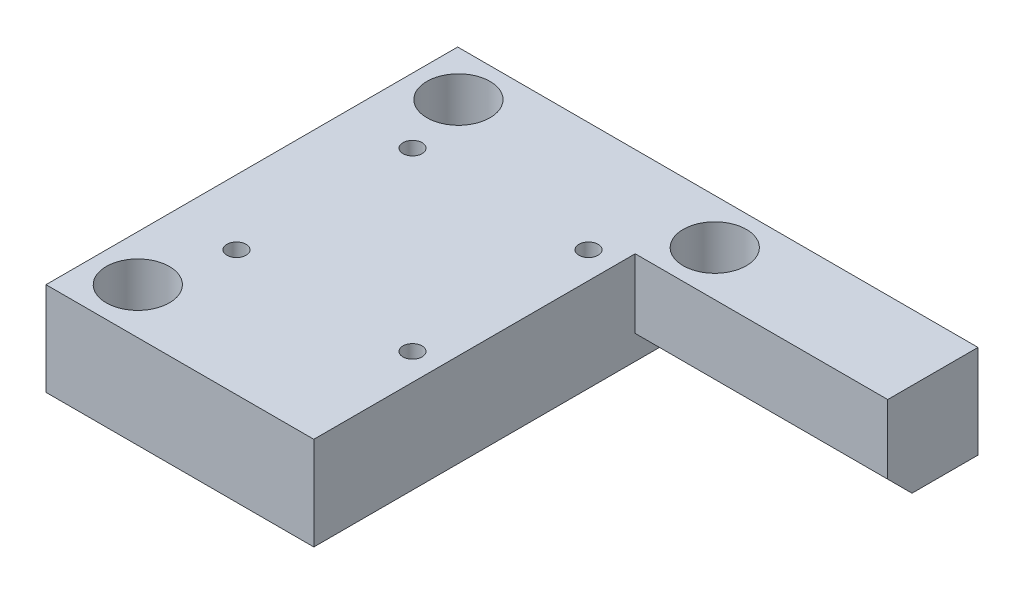
ISO-10303-21;
HEADER;
FILE_DESCRIPTION(('STEP AP214'),'2;1');
FILE_NAME('part.step','',(''),(''),'','','');
FILE_SCHEMA(('AUTOMOTIVE_DESIGN { 1 0 10303 214 1 1 1 1 }'));
ENDSEC;
DATA;
#1=APPLICATION_CONTEXT('core data for automotive mechanical design processes');
#2=APPLICATION_PROTOCOL_DEFINITION('international standard','automotive_design',2000,#1);
#3=PRODUCT_CONTEXT('',#1,'mechanical');
#4=PRODUCT('Part','Part','',(#3));
#5=PRODUCT_RELATED_PRODUCT_CATEGORY('part','',(#4));
#6=PRODUCT_DEFINITION_FORMATION('','',#4);
#7=PRODUCT_DEFINITION_CONTEXT('part definition',#1,'design');
#8=PRODUCT_DEFINITION('design','',#6,#7);
#9=PRODUCT_DEFINITION_SHAPE('','',#8);
#10=(LENGTH_UNIT() NAMED_UNIT(*) SI_UNIT(.MILLI.,.METRE.));
#11=(NAMED_UNIT(*) PLANE_ANGLE_UNIT() SI_UNIT($,.RADIAN.));
#12=(NAMED_UNIT(*) SI_UNIT($,.STERADIAN.) SOLID_ANGLE_UNIT());
#13=UNCERTAINTY_MEASURE_WITH_UNIT(LENGTH_MEASURE(1.E-05),#10,'distance_accuracy_value','');
#14=(GEOMETRIC_REPRESENTATION_CONTEXT(3) GLOBAL_UNCERTAINTY_ASSIGNED_CONTEXT((#13)) GLOBAL_UNIT_ASSIGNED_CONTEXT((#10,
#11,#12)) REPRESENTATION_CONTEXT('',''));
#15=CARTESIAN_POINT('',(0.,0.,0.));
#16=DIRECTION('',(0.,0.,1.));
#17=DIRECTION('',(1.,0.,0.));
#18=AXIS2_PLACEMENT_3D('',#15,#16,#17);
#19=CARTESIAN_POINT('',(6.,-12.19205,47.8));
#20=DIRECTION('',(0.,1.,0.));
#21=DIRECTION('',(0.,0.,1.));
#22=AXIS2_PLACEMENT_3D('',#19,#20,#21);
#23=CYLINDRICAL_SURFACE('',#22,2.25000000000001);
#24=CARTESIAN_POINT('',(6.,-12.192,47.8));
#25=DIRECTION('',(0.,1.,0.));
#26=DIRECTION('',(0.,0.,1.));
#27=AXIS2_PLACEMENT_3D('',#24,#25,#26);
#28=CIRCLE('',#27,2.25000000000001);
#29=CARTESIAN_POINT('',(6.,-12.192,50.05));
#30=VERTEX_POINT('',#29);
#31=EDGE_CURVE('E118',#30,#30,#28,.T.);
#32=ORIENTED_EDGE('',*,*,#31,.F.);
#33=EDGE_LOOP('',(#32));
#34=FACE_BOUND('',#33,.T.);
#35=CARTESIAN_POINT('',(6.,-7.,47.8));
#36=DIRECTION('',(0.,1.,0.));
#37=DIRECTION('',(0.,0.,1.));
#38=AXIS2_PLACEMENT_3D('',#35,#36,#37);
#39=CIRCLE('',#38,2.25000000000001);
#40=CARTESIAN_POINT('',(6.,-7.,50.05));
#41=VERTEX_POINT('',#40);
#42=EDGE_CURVE('E132',#41,#41,#39,.F.);
#43=ORIENTED_EDGE('',*,*,#42,.F.);
#44=EDGE_LOOP('',(#43));
#45=FACE_BOUND('',#44,.T.);
#46=ADVANCED_FACE('F34',(#34,#45),#23,.F.);
#47=CARTESIAN_POINT('',(6.,-12.192,5.90000000000001));
#48=DIRECTION('',(0.,1.,0.));
#49=DIRECTION('',(0.,0.,1.));
#50=AXIS2_PLACEMENT_3D('',#47,#48,#49);
#51=CYLINDRICAL_SURFACE('',#50,2.25);
#52=CARTESIAN_POINT('',(6.,-12.192,5.90000000000001));
#53=DIRECTION('',(0.,1.,0.));
#54=DIRECTION('',(0.,0.,1.));
#55=AXIS2_PLACEMENT_3D('',#52,#53,#54);
#56=CIRCLE('',#55,2.25);
#57=CARTESIAN_POINT('',(6.,-12.192,8.15000000000001));
#58=VERTEX_POINT('',#57);
#59=EDGE_CURVE('E183',#58,#58,#56,.T.);
#60=ORIENTED_EDGE('',*,*,#59,.F.);
#61=EDGE_LOOP('',(#60));
#62=FACE_BOUND('',#61,.T.);
#63=CARTESIAN_POINT('',(6.,-7.,5.90000000000001));
#64=DIRECTION('',(0.,1.,0.));
#65=DIRECTION('',(0.,0.,1.));
#66=AXIS2_PLACEMENT_3D('',#63,#64,#65);
#67=CIRCLE('',#66,2.25);
#68=CARTESIAN_POINT('',(6.,-7.,8.15000000000001));
#69=VERTEX_POINT('',#68);
#70=EDGE_CURVE('E164',#69,#69,#67,.F.);
#71=ORIENTED_EDGE('',*,*,#70,.F.);
#72=EDGE_LOOP('',(#71));
#73=FACE_BOUND('',#72,.T.);
#74=ADVANCED_FACE('F203',(#62,#73),#51,.F.);
#75=CARTESIAN_POINT('',(39.5,-12.192,5.9));
#76=DIRECTION('',(0.,1.,0.));
#77=DIRECTION('',(0.,0.,1.));
#78=AXIS2_PLACEMENT_3D('',#75,#76,#77);
#79=CYLINDRICAL_SURFACE('',#78,2.24999999999999);
#80=CARTESIAN_POINT('',(39.5,-12.192,5.9));
#81=DIRECTION('',(0.,1.,0.));
#82=DIRECTION('',(0.,0.,1.));
#83=AXIS2_PLACEMENT_3D('',#80,#81,#82);
#84=CIRCLE('',#83,2.24999999999999);
#85=CARTESIAN_POINT('',(39.5,-12.192,8.14999999999999));
#86=VERTEX_POINT('',#85);
#87=EDGE_CURVE('E172',#86,#86,#84,.T.);
#88=ORIENTED_EDGE('',*,*,#87,.F.);
#89=EDGE_LOOP('',(#88));
#90=FACE_BOUND('',#89,.T.);
#91=CARTESIAN_POINT('',(39.5,-7.,5.9));
#92=DIRECTION('',(0.,1.,0.));
#93=DIRECTION('',(0.,0.,1.));
#94=AXIS2_PLACEMENT_3D('',#91,#92,#93);
#95=CIRCLE('',#94,2.24999999999999);
#96=CARTESIAN_POINT('',(39.5,-7.,8.14999999999999));
#97=VERTEX_POINT('',#96);
#98=EDGE_CURVE('E181',#97,#97,#95,.F.);
#99=ORIENTED_EDGE('',*,*,#98,.F.);
#100=EDGE_LOOP('',(#99));
#101=FACE_BOUND('',#100,.T.);
#102=ADVANCED_FACE('F200',(#90,#101),#79,.F.);
#103=CARTESIAN_POINT('',(0.,0.,11.8));
#104=DIRECTION('',(1.,0.,0.));
#105=DIRECTION('',(0.,1.,0.));
#106=AXIS2_PLACEMENT_3D('',#103,#104,#105);
#107=PLANE('',#106);
#108=DIRECTION('',(0.,-1.,0.));
#109=VECTOR('',#108,1.);
#110=CARTESIAN_POINT('',(0.,0.,0.));
#111=LINE('',#110,#109);
#112=CARTESIAN_POINT('',(0.,0.,0.));
#113=VERTEX_POINT('',#112);
#114=CARTESIAN_POINT('',(0.,-12.192,0.));
#115=VERTEX_POINT('',#114);
#116=EDGE_CURVE('E101',#113,#115,#111,.T.);
#117=ORIENTED_EDGE('',*,*,#116,.T.);
#118=DIRECTION('',(0.,0.,-1.));
#119=VECTOR('',#118,1.);
#120=CARTESIAN_POINT('',(0.,-12.192,11.8));
#121=LINE('',#120,#119);
#122=CARTESIAN_POINT('',(0.,-12.192,53.8));
#123=VERTEX_POINT('',#122);
#124=EDGE_CURVE('E94',#123,#115,#121,.T.);
#125=ORIENTED_EDGE('',*,*,#124,.F.);
#126=DIRECTION('',(0.,-1.,0.));
#127=VECTOR('',#126,1.);
#128=CARTESIAN_POINT('',(0.,0.,53.8));
#129=LINE('',#128,#127);
#130=CARTESIAN_POINT('',(0.,0.,53.8));
#131=VERTEX_POINT('',#130);
#132=EDGE_CURVE('E99',#131,#123,#129,.T.);
#133=ORIENTED_EDGE('',*,*,#132,.F.);
#134=DIRECTION('',(0.,0.,-1.));
#135=VECTOR('',#134,1.);
#136=CARTESIAN_POINT('',(0.,0.,11.8));
#137=LINE('',#136,#135);
#138=EDGE_CURVE('E153',#131,#113,#137,.T.);
#139=ORIENTED_EDGE('',*,*,#138,.T.);
#140=EDGE_LOOP('',(#117,#125,#133,#139));
#141=FACE_BOUND('',#140,.T.);
#142=ADVANCED_FACE('F96',(#141),#107,.F.);
#143=CARTESIAN_POINT('',(0.,-12.192,11.8));
#144=DIRECTION('',(0.,1.,0.));
#145=DIRECTION('',(0.,0.,1.));
#146=AXIS2_PLACEMENT_3D('',#143,#144,#145);
#147=PLANE('',#146);
#148=CARTESIAN_POINT('',(31.5021834883644,-12.192,14.402424999977));
#149=DIRECTION('',(0.,1.,0.));
#150=DIRECTION('',(0.,0.,1.));
#151=AXIS2_PLACEMENT_3D('',#148,#149,#150);
#152=CIRCLE('',#151,1.2499999999937);
#153=CARTESIAN_POINT('',(31.5021834883644,-12.192,15.6524249999707));
#154=VERTEX_POINT('',#153);
#155=EDGE_CURVE('E268',#154,#154,#152,.F.);
#156=ORIENTED_EDGE('',*,*,#155,.F.);
#157=EDGE_LOOP('',(#156));
#158=FACE_BOUND('',#157,.T.);
#159=CARTESIAN_POINT('',(31.5000000000003,-12.192,37.4046084883411));
#160=DIRECTION('',(0.,1.,0.));
#161=DIRECTION('',(0.,0.,1.));
#162=AXIS2_PLACEMENT_3D('',#159,#160,#161);
#163=CIRCLE('',#162,1.24999999999371);
#164=CARTESIAN_POINT('',(31.5000000000003,-12.192,38.6546084883348));
#165=VERTEX_POINT('',#164);
#166=EDGE_CURVE('E272',#165,#165,#163,.F.);
#167=ORIENTED_EDGE('',*,*,#166,.F.);
#168=EDGE_LOOP('',(#167));
#169=FACE_BOUND('',#168,.T.);
#170=CARTESIAN_POINT('',(8.497816511636,-12.192,37.4024249999771));
#171=DIRECTION('',(0.,1.,0.));
#172=DIRECTION('',(0.,0.,1.));
#173=AXIS2_PLACEMENT_3D('',#170,#171,#172);
#174=CIRCLE('',#173,1.2499999999937);
#175=CARTESIAN_POINT('',(8.497816511636,-12.192,38.6524249999708));
#176=VERTEX_POINT('',#175);
#177=EDGE_CURVE('E276',#176,#176,#174,.F.);
#178=ORIENTED_EDGE('',*,*,#177,.F.);
#179=EDGE_LOOP('',(#178));
#180=FACE_BOUND('',#179,.T.);
#181=CARTESIAN_POINT('',(8.50000000000008,-12.192,14.4002415116128));
#182=DIRECTION('',(0.,1.,0.));
#183=DIRECTION('',(0.,0.,1.));
#184=AXIS2_PLACEMENT_3D('',#181,#182,#183);
#185=CIRCLE('',#184,1.24999999999369);
#186=CARTESIAN_POINT('',(8.50000000000008,-12.192,15.6502415116065));
#187=VERTEX_POINT('',#186);
#188=EDGE_CURVE('E280',#187,#187,#185,.F.);
#189=ORIENTED_EDGE('',*,*,#188,.F.);
#190=EDGE_LOOP('',(#189));
#191=FACE_BOUND('',#190,.T.);
#192=ORIENTED_EDGE('',*,*,#31,.T.);
#193=EDGE_LOOP('',(#192));
#194=FACE_BOUND('',#193,.T.);
#195=ORIENTED_EDGE('',*,*,#59,.T.);
#196=EDGE_LOOP('',(#195));
#197=FACE_BOUND('',#196,.T.);
#198=ORIENTED_EDGE('',*,*,#87,.T.);
#199=EDGE_LOOP('',(#198));
#200=FACE_BOUND('',#199,.T.);
#201=DIRECTION('',(0.,0.,-1.));
#202=VECTOR('',#201,1.);
#203=CARTESIAN_POINT('',(68.,-12.192,11.8));
#204=LINE('',#203,#202);
#205=CARTESIAN_POINT('',(68.,-12.192,8.62499999999999));
#206=VERTEX_POINT('',#205);
#207=CARTESIAN_POINT('',(68.,-12.192,0.));
#208=VERTEX_POINT('',#207);
#209=EDGE_CURVE('E105',#206,#208,#204,.T.);
#210=ORIENTED_EDGE('',*,*,#209,.F.);
#211=DIRECTION('',(-1.,0.,0.));
#212=VECTOR('',#211,1.);
#213=CARTESIAN_POINT('',(35.,-12.192,8.62499999999999));
#214=LINE('',#213,#212);
#215=CARTESIAN_POINT('',(35.,-12.192,8.62500000000001));
#216=VERTEX_POINT('',#215);
#217=EDGE_CURVE('E42',#206,#216,#214,.T.);
#218=ORIENTED_EDGE('',*,*,#217,.T.);
#219=DIRECTION('',(0.,0.,-1.));
#220=VECTOR('',#219,1.);
#221=CARTESIAN_POINT('',(35.,-12.192,53.8));
#222=LINE('',#221,#220);
#223=CARTESIAN_POINT('',(35.,-12.192,53.8));
#224=VERTEX_POINT('',#223);
#225=EDGE_CURVE('E48',#224,#216,#222,.T.);
#226=ORIENTED_EDGE('',*,*,#225,.F.);
#227=DIRECTION('',(1.,0.,0.));
#228=VECTOR('',#227,1.);
#229=CARTESIAN_POINT('',(0.,-12.192,53.8));
#230=LINE('',#229,#228);
#231=EDGE_CURVE('E107',#123,#224,#230,.T.);
#232=ORIENTED_EDGE('',*,*,#231,.F.);
#233=ORIENTED_EDGE('',*,*,#124,.T.);
#234=DIRECTION('',(1.,0.,0.));
#235=VECTOR('',#234,1.);
#236=CARTESIAN_POINT('',(0.,-12.192,0.));
#237=LINE('',#236,#235);
#238=EDGE_CURVE('E171',#115,#208,#237,.T.);
#239=ORIENTED_EDGE('',*,*,#238,.T.);
#240=EDGE_LOOP('',(#210,#218,#226,#232,#233,#239));
#241=FACE_BOUND('',#240,.T.);
#242=ADVANCED_FACE('F108',(#158,#169,#180,#191,#194,#197,#200,#241),#147,.F.);
#243=CARTESIAN_POINT('',(68.,0.,11.8));
#244=DIRECTION('',(-1.,0.,0.));
#245=DIRECTION('',(0.,0.,1.));
#246=AXIS2_PLACEMENT_3D('',#243,#244,#245);
#247=PLANE('',#246);
#248=DIRECTION('',(0.,1.,0.));
#249=VECTOR('',#248,1.);
#250=CARTESIAN_POINT('',(68.,0.,11.8));
#251=LINE('',#250,#249);
#252=CARTESIAN_POINT('',(68.,-9.017,11.8));
#253=VERTEX_POINT('',#252);
#254=CARTESIAN_POINT('',(68.,0.,11.8));
#255=VERTEX_POINT('',#254);
#256=EDGE_CURVE('E149',#253,#255,#251,.T.);
#257=ORIENTED_EDGE('',*,*,#256,.F.);
#258=DIRECTION('',(0.,-0.707106781186546,-0.707106781186549));
#259=VECTOR('',#258,1.);
#260=CARTESIAN_POINT('',(68.,-9.017,11.8));
#261=LINE('',#260,#259);
#262=EDGE_CURVE('E56',#253,#206,#261,.T.);
#263=ORIENTED_EDGE('',*,*,#262,.T.);
#264=ORIENTED_EDGE('',*,*,#209,.T.);
#265=DIRECTION('',(0.,1.,0.));
#266=VECTOR('',#265,1.);
#267=CARTESIAN_POINT('',(68.,0.,0.));
#268=LINE('',#267,#266);
#269=CARTESIAN_POINT('',(68.,0.,0.));
#270=VERTEX_POINT('',#269);
#271=EDGE_CURVE('E174',#208,#270,#268,.T.);
#272=ORIENTED_EDGE('',*,*,#271,.T.);
#273=DIRECTION('',(0.,0.,-1.));
#274=VECTOR('',#273,1.);
#275=CARTESIAN_POINT('',(68.,0.,11.8));
#276=LINE('',#275,#274);
#277=EDGE_CURVE('E179',#255,#270,#276,.T.);
#278=ORIENTED_EDGE('',*,*,#277,.F.);
#279=EDGE_LOOP('',(#257,#263,#264,#272,#278));
#280=FACE_BOUND('',#279,.T.);
#281=ADVANCED_FACE('F249',(#280),#247,.F.);
#282=CARTESIAN_POINT('',(0.,0.,11.8));
#283=DIRECTION('',(0.,-1.,0.));
#284=DIRECTION('',(0.,0.,-1.));
#285=AXIS2_PLACEMENT_3D('',#282,#283,#284);
#286=PLANE('',#285);
#287=CARTESIAN_POINT('',(31.5021834883644,0.,14.402424999977));
#288=DIRECTION('',(0.,1.,0.));
#289=DIRECTION('',(0.,0.,1.));
#290=AXIS2_PLACEMENT_3D('',#287,#288,#289);
#291=CIRCLE('',#290,1.2499999999937);
#292=CARTESIAN_POINT('',(31.5021834883644,0.,15.6524249999707));
#293=VERTEX_POINT('',#292);
#294=EDGE_CURVE('E318',#293,#293,#291,.T.);
#295=ORIENTED_EDGE('',*,*,#294,.F.);
#296=EDGE_LOOP('',(#295));
#297=FACE_BOUND('',#296,.T.);
#298=CARTESIAN_POINT('',(31.5000000000003,0.,37.4046084883411));
#299=DIRECTION('',(0.,1.,0.));
#300=DIRECTION('',(0.,0.,1.));
#301=AXIS2_PLACEMENT_3D('',#298,#299,#300);
#302=CIRCLE('',#301,1.24999999999371);
#303=CARTESIAN_POINT('',(31.5000000000003,0.,38.6546084883348));
#304=VERTEX_POINT('',#303);
#305=EDGE_CURVE('E314',#304,#304,#302,.T.);
#306=ORIENTED_EDGE('',*,*,#305,.F.);
#307=EDGE_LOOP('',(#306));
#308=FACE_BOUND('',#307,.T.);
#309=CARTESIAN_POINT('',(8.497816511636,0.,37.4024249999771));
#310=DIRECTION('',(0.,1.,0.));
#311=DIRECTION('',(0.,0.,1.));
#312=AXIS2_PLACEMENT_3D('',#309,#310,#311);
#313=CIRCLE('',#312,1.2499999999937);
#314=CARTESIAN_POINT('',(8.497816511636,0.,38.6524249999708));
#315=VERTEX_POINT('',#314);
#316=EDGE_CURVE('E310',#315,#315,#313,.T.);
#317=ORIENTED_EDGE('',*,*,#316,.F.);
#318=EDGE_LOOP('',(#317));
#319=FACE_BOUND('',#318,.T.);
#320=CARTESIAN_POINT('',(8.50000000000008,0.,14.4002415116128));
#321=DIRECTION('',(0.,1.,0.));
#322=DIRECTION('',(0.,0.,1.));
#323=AXIS2_PLACEMENT_3D('',#320,#321,#322);
#324=CIRCLE('',#323,1.24999999999369);
#325=CARTESIAN_POINT('',(8.50000000000008,0.,15.6502415116065));
#326=VERTEX_POINT('',#325);
#327=EDGE_CURVE('E306',#326,#326,#324,.T.);
#328=ORIENTED_EDGE('',*,*,#327,.F.);
#329=EDGE_LOOP('',(#328));
#330=FACE_BOUND('',#329,.T.);
#331=CARTESIAN_POINT('',(6.,0.,47.8));
#332=DIRECTION('',(0.,1.,0.));
#333=DIRECTION('',(0.,0.,1.));
#334=AXIS2_PLACEMENT_3D('',#331,#332,#333);
#335=CIRCLE('',#334,4.125);
#336=CARTESIAN_POINT('',(6.,0.,51.925));
#337=VERTEX_POINT('',#336);
#338=EDGE_CURVE('E299',#337,#337,#335,.T.);
#339=ORIENTED_EDGE('',*,*,#338,.F.);
#340=EDGE_LOOP('',(#339));
#341=FACE_BOUND('',#340,.T.);
#342=CARTESIAN_POINT('',(6.,0.,5.90000000000001));
#343=DIRECTION('',(0.,1.,0.));
#344=DIRECTION('',(0.,0.,1.));
#345=AXIS2_PLACEMENT_3D('',#342,#343,#344);
#346=CIRCLE('',#345,4.125);
#347=CARTESIAN_POINT('',(6.,0.,10.025));
#348=VERTEX_POINT('',#347);
#349=EDGE_CURVE('E157',#348,#348,#346,.T.);
#350=ORIENTED_EDGE('',*,*,#349,.F.);
#351=EDGE_LOOP('',(#350));
#352=FACE_BOUND('',#351,.T.);
#353=CARTESIAN_POINT('',(39.5,0.,5.9));
#354=DIRECTION('',(0.,1.,0.));
#355=DIRECTION('',(0.,0.,1.));
#356=AXIS2_PLACEMENT_3D('',#353,#354,#355);
#357=CIRCLE('',#356,4.125);
#358=CARTESIAN_POINT('',(39.5,0.,10.025));
#359=VERTEX_POINT('',#358);
#360=EDGE_CURVE('E190',#359,#359,#357,.T.);
#361=ORIENTED_EDGE('',*,*,#360,.F.);
#362=EDGE_LOOP('',(#361));
#363=FACE_BOUND('',#362,.T.);
#364=DIRECTION('',(-1.,0.,0.));
#365=VECTOR('',#364,1.);
#366=CARTESIAN_POINT('',(0.,0.,0.));
#367=LINE('',#366,#365);
#368=EDGE_CURVE('E176',#270,#113,#367,.T.);
#369=ORIENTED_EDGE('',*,*,#368,.T.);
#370=ORIENTED_EDGE('',*,*,#138,.F.);
#371=DIRECTION('',(-1.,0.,0.));
#372=VECTOR('',#371,1.);
#373=CARTESIAN_POINT('',(0.,0.,53.8));
#374=LINE('',#373,#372);
#375=CARTESIAN_POINT('',(35.,0.,53.8));
#376=VERTEX_POINT('',#375);
#377=EDGE_CURVE('E115',#376,#131,#374,.T.);
#378=ORIENTED_EDGE('',*,*,#377,.F.);
#379=DIRECTION('',(0.,0.,-1.));
#380=VECTOR('',#379,1.);
#381=CARTESIAN_POINT('',(35.,0.,53.8));
#382=LINE('',#381,#380);
#383=CARTESIAN_POINT('',(35.,0.,11.8));
#384=VERTEX_POINT('',#383);
#385=EDGE_CURVE('E125',#376,#384,#382,.T.);
#386=ORIENTED_EDGE('',*,*,#385,.T.);
#387=DIRECTION('',(-1.,0.,0.));
#388=VECTOR('',#387,1.);
#389=CARTESIAN_POINT('',(0.,0.,11.8));
#390=LINE('',#389,#388);
#391=EDGE_CURVE('E147',#255,#384,#390,.T.);
#392=ORIENTED_EDGE('',*,*,#391,.F.);
#393=ORIENTED_EDGE('',*,*,#277,.T.);
#394=EDGE_LOOP('',(#369,#370,#378,#386,#392,#393));
#395=FACE_BOUND('',#394,.T.);
#396=ADVANCED_FACE('F155',(#297,#308,#319,#330,#341,#352,#363,#395),#286,.F.);
#397=CARTESIAN_POINT('',(0.,0.,11.8));
#398=DIRECTION('',(0.,0.,1.));
#399=DIRECTION('',(1.,0.,0.));
#400=AXIS2_PLACEMENT_3D('',#397,#398,#399);
#401=PLANE('',#400);
#402=DIRECTION('',(0.,1.,0.));
#403=VECTOR('',#402,1.);
#404=CARTESIAN_POINT('',(35.,0.,11.8));
#405=LINE('',#404,#403);
#406=CARTESIAN_POINT('',(35.,-9.017,11.8));
#407=VERTEX_POINT('',#406);
#408=EDGE_CURVE('E116',#407,#384,#405,.T.);
#409=ORIENTED_EDGE('',*,*,#408,.F.);
#410=DIRECTION('',(1.,0.,0.));
#411=VECTOR('',#410,1.);
#412=CARTESIAN_POINT('',(68.,-9.017,11.8));
#413=LINE('',#412,#411);
#414=EDGE_CURVE('E104',#407,#253,#413,.T.);
#415=ORIENTED_EDGE('',*,*,#414,.T.);
#416=ORIENTED_EDGE('',*,*,#256,.T.);
#417=ORIENTED_EDGE('',*,*,#391,.T.);
#418=EDGE_LOOP('',(#409,#415,#416,#417));
#419=FACE_BOUND('',#418,.T.);
#420=ADVANCED_FACE('F145',(#419),#401,.T.);
#421=CARTESIAN_POINT('',(0.,0.,0.));
#422=DIRECTION('',(0.,0.,1.));
#423=DIRECTION('',(1.,0.,0.));
#424=AXIS2_PLACEMENT_3D('',#421,#422,#423);
#425=PLANE('',#424);
#426=ORIENTED_EDGE('',*,*,#116,.F.);
#427=ORIENTED_EDGE('',*,*,#368,.F.);
#428=ORIENTED_EDGE('',*,*,#271,.F.);
#429=ORIENTED_EDGE('',*,*,#238,.F.);
#430=EDGE_LOOP('',(#426,#427,#428,#429));
#431=FACE_BOUND('',#430,.T.);
#432=ADVANCED_FACE('F240',(#431),#425,.F.);
#433=CARTESIAN_POINT('',(39.5,-7.,5.9));
#434=DIRECTION('',(0.,1.,0.));
#435=DIRECTION('',(0.,0.,1.));
#436=AXIS2_PLACEMENT_3D('',#433,#434,#435);
#437=PLANE('',#436);
#438=CARTESIAN_POINT('',(39.5,-7.,5.9));
#439=DIRECTION('',(0.,1.,0.));
#440=DIRECTION('',(0.,0.,1.));
#441=AXIS2_PLACEMENT_3D('',#438,#439,#440);
#442=CIRCLE('',#441,4.125);
#443=CARTESIAN_POINT('',(39.5,-7.,10.025));
#444=VERTEX_POINT('',#443);
#445=EDGE_CURVE('E184',#444,#444,#442,.T.);
#446=ORIENTED_EDGE('',*,*,#445,.T.);
#447=EDGE_LOOP('',(#446));
#448=FACE_BOUND('',#447,.T.);
#449=ORIENTED_EDGE('',*,*,#98,.T.);
#450=EDGE_LOOP('',(#449));
#451=FACE_BOUND('',#450,.T.);
#452=ADVANCED_FACE('F237',(#448,#451),#437,.T.);
#453=CARTESIAN_POINT('',(39.5,-7.,5.9));
#454=DIRECTION('',(0.,1.,0.));
#455=DIRECTION('',(0.,0.,1.));
#456=AXIS2_PLACEMENT_3D('',#453,#454,#455);
#457=CYLINDRICAL_SURFACE('',#456,4.125);
#458=ORIENTED_EDGE('',*,*,#445,.F.);
#459=EDGE_LOOP('',(#458));
#460=FACE_BOUND('',#459,.T.);
#461=ORIENTED_EDGE('',*,*,#360,.T.);
#462=EDGE_LOOP('',(#461));
#463=FACE_BOUND('',#462,.T.);
#464=ADVANCED_FACE('F232',(#460,#463),#457,.F.);
#465=CARTESIAN_POINT('',(6.,-7.,5.90000000000001));
#466=DIRECTION('',(0.,1.,0.));
#467=DIRECTION('',(0.,0.,1.));
#468=AXIS2_PLACEMENT_3D('',#465,#466,#467);
#469=PLANE('',#468);
#470=CARTESIAN_POINT('',(6.,-7.,5.90000000000001));
#471=DIRECTION('',(0.,1.,0.));
#472=DIRECTION('',(0.,0.,1.));
#473=AXIS2_PLACEMENT_3D('',#470,#471,#472);
#474=CIRCLE('',#473,4.125);
#475=CARTESIAN_POINT('',(6.,-7.,10.025));
#476=VERTEX_POINT('',#475);
#477=EDGE_CURVE('E128',#476,#476,#474,.T.);
#478=ORIENTED_EDGE('',*,*,#477,.T.);
#479=EDGE_LOOP('',(#478));
#480=FACE_BOUND('',#479,.T.);
#481=ORIENTED_EDGE('',*,*,#70,.T.);
#482=EDGE_LOOP('',(#481));
#483=FACE_BOUND('',#482,.T.);
#484=ADVANCED_FACE('F229',(#480,#483),#469,.T.);
#485=CARTESIAN_POINT('',(6.,-7.,5.90000000000001));
#486=DIRECTION('',(0.,1.,0.));
#487=DIRECTION('',(0.,0.,1.));
#488=AXIS2_PLACEMENT_3D('',#485,#486,#487);
#489=CYLINDRICAL_SURFACE('',#488,4.125);
#490=ORIENTED_EDGE('',*,*,#477,.F.);
#491=EDGE_LOOP('',(#490));
#492=FACE_BOUND('',#491,.T.);
#493=ORIENTED_EDGE('',*,*,#349,.T.);
#494=EDGE_LOOP('',(#493));
#495=FACE_BOUND('',#494,.T.);
#496=ADVANCED_FACE('F228',(#492,#495),#489,.F.);
#497=CARTESIAN_POINT('',(35.,0.,53.8));
#498=DIRECTION('',(-1.,0.,0.));
#499=DIRECTION('',(0.,0.,1.));
#500=AXIS2_PLACEMENT_3D('',#497,#498,#499);
#501=PLANE('',#500);
#502=ORIENTED_EDGE('',*,*,#225,.T.);
#503=DIRECTION('',(0.,0.707106781186546,0.707106781186549));
#504=VECTOR('',#503,1.);
#505=CARTESIAN_POINT('',(35.,16.4915,37.3085000000001));
#506=LINE('',#505,#504);
#507=EDGE_CURVE('E11',#216,#407,#506,.T.);
#508=ORIENTED_EDGE('',*,*,#507,.T.);
#509=ORIENTED_EDGE('',*,*,#408,.T.);
#510=ORIENTED_EDGE('',*,*,#385,.F.);
#511=DIRECTION('',(0.,1.,0.));
#512=VECTOR('',#511,1.);
#513=CARTESIAN_POINT('',(35.,0.,53.8));
#514=LINE('',#513,#512);
#515=EDGE_CURVE('E110',#224,#376,#514,.T.);
#516=ORIENTED_EDGE('',*,*,#515,.F.);
#517=EDGE_LOOP('',(#502,#508,#509,#510,#516));
#518=FACE_BOUND('',#517,.T.);
#519=ADVANCED_FACE('F141',(#518),#501,.F.);
#520=CARTESIAN_POINT('',(0.,0.,53.8));
#521=DIRECTION('',(0.,0.,1.));
#522=DIRECTION('',(1.,0.,0.));
#523=AXIS2_PLACEMENT_3D('',#520,#521,#522);
#524=PLANE('',#523);
#525=ORIENTED_EDGE('',*,*,#132,.T.);
#526=ORIENTED_EDGE('',*,*,#231,.T.);
#527=ORIENTED_EDGE('',*,*,#515,.T.);
#528=ORIENTED_EDGE('',*,*,#377,.T.);
#529=EDGE_LOOP('',(#525,#526,#527,#528));
#530=FACE_BOUND('',#529,.T.);
#531=ADVANCED_FACE('F113',(#530),#524,.T.);
#532=CARTESIAN_POINT('',(6.,-7.,47.8));
#533=DIRECTION('',(0.,1.,0.));
#534=DIRECTION('',(0.,0.,1.));
#535=AXIS2_PLACEMENT_3D('',#532,#533,#534);
#536=PLANE('',#535);
#537=CARTESIAN_POINT('',(6.,-7.,47.8));
#538=DIRECTION('',(0.,1.,0.));
#539=DIRECTION('',(0.,0.,1.));
#540=AXIS2_PLACEMENT_3D('',#537,#538,#539);
#541=CIRCLE('',#540,4.125);
#542=CARTESIAN_POINT('',(6.,-7.,51.925));
#543=VERTEX_POINT('',#542);
#544=EDGE_CURVE('E295',#543,#543,#541,.T.);
#545=ORIENTED_EDGE('',*,*,#544,.T.);
#546=EDGE_LOOP('',(#545));
#547=FACE_BOUND('',#546,.T.);
#548=ORIENTED_EDGE('',*,*,#42,.T.);
#549=EDGE_LOOP('',(#548));
#550=FACE_BOUND('',#549,.T.);
#551=ADVANCED_FACE('F225',(#547,#550),#536,.T.);
#552=CARTESIAN_POINT('',(6.,-7.,47.8));
#553=DIRECTION('',(0.,1.,0.));
#554=DIRECTION('',(0.,0.,1.));
#555=AXIS2_PLACEMENT_3D('',#552,#553,#554);
#556=CYLINDRICAL_SURFACE('',#555,4.125);
#557=ORIENTED_EDGE('',*,*,#544,.F.);
#558=EDGE_LOOP('',(#557));
#559=FACE_BOUND('',#558,.T.);
#560=ORIENTED_EDGE('',*,*,#338,.T.);
#561=EDGE_LOOP('',(#560));
#562=FACE_BOUND('',#561,.T.);
#563=ADVANCED_FACE('F221',(#559,#562),#556,.F.);
#564=CARTESIAN_POINT('',(8.50000000000008,-12.19305,14.4002415116128));
#565=DIRECTION('',(0.,1.,0.));
#566=DIRECTION('',(0.,0.,1.));
#567=AXIS2_PLACEMENT_3D('',#564,#565,#566);
#568=CYLINDRICAL_SURFACE('',#567,1.24999999999369);
#569=ORIENTED_EDGE('',*,*,#327,.T.);
#570=EDGE_LOOP('',(#569));
#571=FACE_BOUND('',#570,.T.);
#572=ORIENTED_EDGE('',*,*,#188,.T.);
#573=EDGE_LOOP('',(#572));
#574=FACE_BOUND('',#573,.T.);
#575=ADVANCED_FACE('F336',(#571,#574),#568,.F.);
#576=CARTESIAN_POINT('',(8.497816511636,-12.19305,37.4024249999771));
#577=DIRECTION('',(0.,1.,0.));
#578=DIRECTION('',(0.,0.,1.));
#579=AXIS2_PLACEMENT_3D('',#576,#577,#578);
#580=CYLINDRICAL_SURFACE('',#579,1.2499999999937);
#581=ORIENTED_EDGE('',*,*,#316,.T.);
#582=EDGE_LOOP('',(#581));
#583=FACE_BOUND('',#582,.T.);
#584=ORIENTED_EDGE('',*,*,#177,.T.);
#585=EDGE_LOOP('',(#584));
#586=FACE_BOUND('',#585,.T.);
#587=ADVANCED_FACE('F330',(#583,#586),#580,.F.);
#588=CARTESIAN_POINT('',(31.5000000000003,-12.19305,37.4046084883411));
#589=DIRECTION('',(0.,1.,0.));
#590=DIRECTION('',(0.,0.,1.));
#591=AXIS2_PLACEMENT_3D('',#588,#589,#590);
#592=CYLINDRICAL_SURFACE('',#591,1.24999999999371);
#593=ORIENTED_EDGE('',*,*,#305,.T.);
#594=EDGE_LOOP('',(#593));
#595=FACE_BOUND('',#594,.T.);
#596=ORIENTED_EDGE('',*,*,#166,.T.);
#597=EDGE_LOOP('',(#596));
#598=FACE_BOUND('',#597,.T.);
#599=ADVANCED_FACE('F324',(#595,#598),#592,.F.);
#600=CARTESIAN_POINT('',(31.5021834883644,-12.19305,14.402424999977));
#601=DIRECTION('',(0.,1.,0.));
#602=DIRECTION('',(0.,0.,1.));
#603=AXIS2_PLACEMENT_3D('',#600,#601,#602);
#604=CYLINDRICAL_SURFACE('',#603,1.2499999999937);
#605=ORIENTED_EDGE('',*,*,#294,.T.);
#606=EDGE_LOOP('',(#605));
#607=FACE_BOUND('',#606,.T.);
#608=ORIENTED_EDGE('',*,*,#155,.T.);
#609=EDGE_LOOP('',(#608));
#610=FACE_BOUND('',#609,.T.);
#611=ADVANCED_FACE('F321',(#607,#610),#604,.F.);
#612=CARTESIAN_POINT('',(0.,-9.017,11.8));
#613=DIRECTION('',(0.,-0.707106781186549,0.707106781186546));
#614=DIRECTION('',(-1.,0.,0.));
#615=AXIS2_PLACEMENT_3D('',#612,#613,#614);
#616=PLANE('',#615);
#617=ORIENTED_EDGE('',*,*,#507,.F.);
#618=ORIENTED_EDGE('',*,*,#217,.F.);
#619=ORIENTED_EDGE('',*,*,#262,.F.);
#620=ORIENTED_EDGE('',*,*,#414,.F.);
#621=EDGE_LOOP('',(#617,#618,#619,#620));
#622=FACE_BOUND('',#621,.T.);
#623=ADVANCED_FACE('F36',(#622),#616,.T.);
#624=CLOSED_SHELL('',(#46,#74,#102,#142,#242,#281,#396,#420,#432,#452,#464,#484,#496,#519,#531,
#551,#563,#575,#587,#599,#611,#623));
#625=MANIFOLD_SOLID_BREP('B2',#624);
#626=ADVANCED_BREP_SHAPE_REPRESENTATION('',(#18,#625),#14);
#627=SHAPE_DEFINITION_REPRESENTATION(#9,#626);
ENDSEC;
END-ISO-10303-21;
